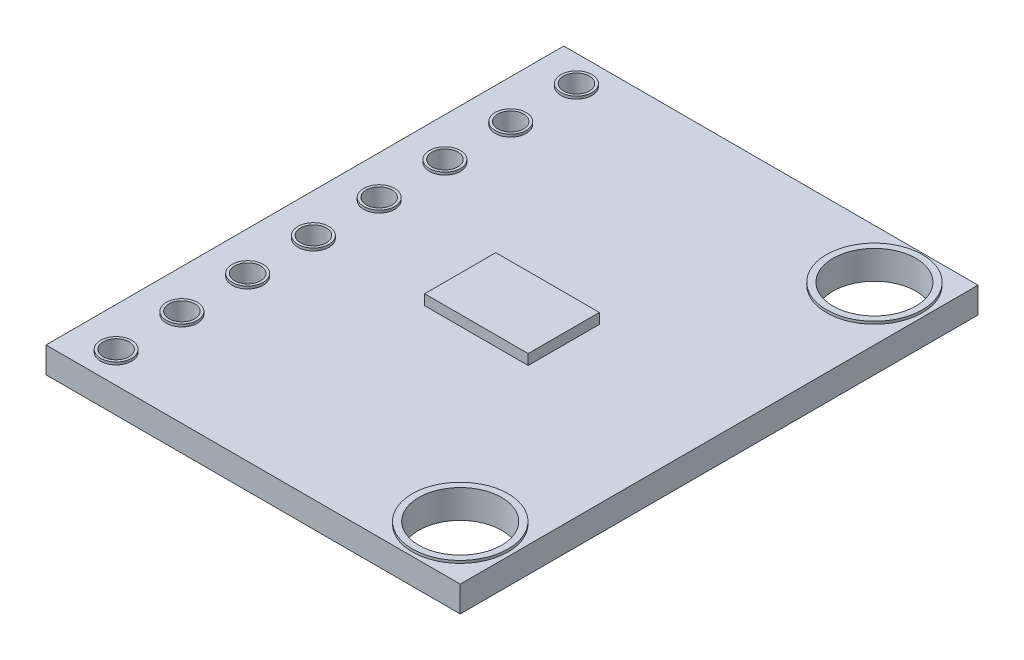
ISO-10303-21;
HEADER;
FILE_DESCRIPTION(('STEP AP214'),'2;1');
FILE_NAME('part.step','',(''),(''),'','','');
FILE_SCHEMA(('AUTOMOTIVE_DESIGN { 1 0 10303 214 1 1 1 1 }'));
ENDSEC;
DATA;
#1=APPLICATION_CONTEXT('core data for automotive mechanical design processes');
#2=APPLICATION_PROTOCOL_DEFINITION('international standard','automotive_design',2000,#1);
#3=PRODUCT_CONTEXT('',#1,'mechanical');
#4=PRODUCT('Part','Part','',(#3));
#5=PRODUCT_RELATED_PRODUCT_CATEGORY('part','',(#4));
#6=PRODUCT_DEFINITION_FORMATION('','',#4);
#7=PRODUCT_DEFINITION_CONTEXT('part definition',#1,'design');
#8=PRODUCT_DEFINITION('design','',#6,#7);
#9=PRODUCT_DEFINITION_SHAPE('','',#8);
#10=(LENGTH_UNIT() NAMED_UNIT(*) SI_UNIT(.MILLI.,.METRE.));
#11=(NAMED_UNIT(*) PLANE_ANGLE_UNIT() SI_UNIT($,.RADIAN.));
#12=(NAMED_UNIT(*) SI_UNIT($,.STERADIAN.) SOLID_ANGLE_UNIT());
#13=UNCERTAINTY_MEASURE_WITH_UNIT(LENGTH_MEASURE(1.E-05),#10,'distance_accuracy_value','');
#14=(GEOMETRIC_REPRESENTATION_CONTEXT(3) GLOBAL_UNCERTAINTY_ASSIGNED_CONTEXT((#13)) GLOBAL_UNIT_ASSIGNED_CONTEXT((#10,
#11,#12)) REPRESENTATION_CONTEXT('',''));
#15=CARTESIAN_POINT('',(0.,0.,0.));
#16=DIRECTION('',(0.,0.,1.));
#17=DIRECTION('',(1.,0.,0.));
#18=AXIS2_PLACEMENT_3D('',#15,#16,#17);
#19=CARTESIAN_POINT('',(2.,1.4,1.375));
#20=DIRECTION('',(-1.,0.,0.));
#21=DIRECTION('',(0.,0.,1.));
#22=AXIS2_PLACEMENT_3D('',#19,#20,#21);
#23=PLANE('',#22);
#24=DIRECTION('',(0.,0.,-1.));
#25=VECTOR('',#24,1.);
#26=CARTESIAN_POINT('',(2.,1.,1.375));
#27=LINE('',#26,#25);
#28=CARTESIAN_POINT('',(2.,1.,1.375));
#29=VERTEX_POINT('',#28);
#30=CARTESIAN_POINT('',(2.,1.,-1.375));
#31=VERTEX_POINT('',#30);
#32=EDGE_CURVE('E115',#29,#31,#27,.T.);
#33=ORIENTED_EDGE('',*,*,#32,.T.);
#34=DIRECTION('',(0.,-1.,0.));
#35=VECTOR('',#34,1.);
#36=CARTESIAN_POINT('',(2.,1.4,-1.375));
#37=LINE('',#36,#35);
#38=CARTESIAN_POINT('',(2.,1.4,-1.375));
#39=VERTEX_POINT('',#38);
#40=EDGE_CURVE('E12',#39,#31,#37,.T.);
#41=ORIENTED_EDGE('',*,*,#40,.F.);
#42=DIRECTION('',(0.,0.,-1.));
#43=VECTOR('',#42,1.);
#44=CARTESIAN_POINT('',(2.,1.4,1.375));
#45=LINE('',#44,#43);
#46=CARTESIAN_POINT('',(2.,1.4,1.375));
#47=VERTEX_POINT('',#46);
#48=EDGE_CURVE('E103',#47,#39,#45,.T.);
#49=ORIENTED_EDGE('',*,*,#48,.F.);
#50=DIRECTION('',(0.,-1.,0.));
#51=VECTOR('',#50,1.);
#52=CARTESIAN_POINT('',(2.,1.4,1.375));
#53=LINE('',#52,#51);
#54=EDGE_CURVE('E111',#47,#29,#53,.T.);
#55=ORIENTED_EDGE('',*,*,#54,.T.);
#56=EDGE_LOOP('',(#33,#41,#49,#55));
#57=FACE_BOUND('',#56,.T.);
#58=ADVANCED_FACE('F52',(#57),#23,.F.);
#59=CARTESIAN_POINT('',(-2.,1.4,-1.375));
#60=DIRECTION('',(0.,0.,1.));
#61=DIRECTION('',(1.,0.,0.));
#62=AXIS2_PLACEMENT_3D('',#59,#60,#61);
#63=PLANE('',#62);
#64=DIRECTION('',(-1.,0.,0.));
#65=VECTOR('',#64,1.);
#66=CARTESIAN_POINT('',(-2.,1.,-1.375));
#67=LINE('',#66,#65);
#68=CARTESIAN_POINT('',(-2.,1.,-1.375));
#69=VERTEX_POINT('',#68);
#70=EDGE_CURVE('E107',#31,#69,#67,.T.);
#71=ORIENTED_EDGE('',*,*,#70,.T.);
#72=DIRECTION('',(0.,-1.,0.));
#73=VECTOR('',#72,1.);
#74=CARTESIAN_POINT('',(-2.,1.4,-1.375));
#75=LINE('',#74,#73);
#76=CARTESIAN_POINT('',(-2.,1.4,-1.375));
#77=VERTEX_POINT('',#76);
#78=EDGE_CURVE('E60',#77,#69,#75,.T.);
#79=ORIENTED_EDGE('',*,*,#78,.F.);
#80=DIRECTION('',(-1.,0.,0.));
#81=VECTOR('',#80,1.);
#82=CARTESIAN_POINT('',(-2.,1.4,-1.375));
#83=LINE('',#82,#81);
#84=EDGE_CURVE('E98',#39,#77,#83,.T.);
#85=ORIENTED_EDGE('',*,*,#84,.F.);
#86=ORIENTED_EDGE('',*,*,#40,.T.);
#87=EDGE_LOOP('',(#71,#79,#85,#86));
#88=FACE_BOUND('',#87,.T.);
#89=ADVANCED_FACE('F106',(#88),#63,.F.);
#90=CARTESIAN_POINT('',(-2.,1.4,1.375));
#91=DIRECTION('',(1.,0.,0.));
#92=DIRECTION('',(0.,0.,-1.));
#93=AXIS2_PLACEMENT_3D('',#90,#91,#92);
#94=PLANE('',#93);
#95=DIRECTION('',(0.,0.,1.));
#96=VECTOR('',#95,1.);
#97=CARTESIAN_POINT('',(-2.,1.,1.375));
#98=LINE('',#97,#96);
#99=CARTESIAN_POINT('',(-2.,1.,1.375));
#100=VERTEX_POINT('',#99);
#101=EDGE_CURVE('E85',#69,#100,#98,.T.);
#102=ORIENTED_EDGE('',*,*,#101,.T.);
#103=DIRECTION('',(0.,-1.,0.));
#104=VECTOR('',#103,1.);
#105=CARTESIAN_POINT('',(-2.,1.4,1.375));
#106=LINE('',#105,#104);
#107=CARTESIAN_POINT('',(-2.,1.4,1.375));
#108=VERTEX_POINT('',#107);
#109=EDGE_CURVE('E108',#108,#100,#106,.T.);
#110=ORIENTED_EDGE('',*,*,#109,.F.);
#111=DIRECTION('',(0.,0.,1.));
#112=VECTOR('',#111,1.);
#113=CARTESIAN_POINT('',(-2.,1.4,1.375));
#114=LINE('',#113,#112);
#115=EDGE_CURVE('E101',#77,#108,#114,.T.);
#116=ORIENTED_EDGE('',*,*,#115,.F.);
#117=ORIENTED_EDGE('',*,*,#78,.T.);
#118=EDGE_LOOP('',(#102,#110,#116,#117));
#119=FACE_BOUND('',#118,.T.);
#120=ADVANCED_FACE('F109',(#119),#94,.F.);
#121=CARTESIAN_POINT('',(-2.,1.4,1.375));
#122=DIRECTION('',(0.,0.,-1.));
#123=DIRECTION('',(-1.,0.,0.));
#124=AXIS2_PLACEMENT_3D('',#121,#122,#123);
#125=PLANE('',#124);
#126=DIRECTION('',(1.,0.,0.));
#127=VECTOR('',#126,1.);
#128=CARTESIAN_POINT('',(-2.,1.,1.375));
#129=LINE('',#128,#127);
#130=EDGE_CURVE('E91',#100,#29,#129,.T.);
#131=ORIENTED_EDGE('',*,*,#130,.T.);
#132=ORIENTED_EDGE('',*,*,#54,.F.);
#133=DIRECTION('',(1.,0.,0.));
#134=VECTOR('',#133,1.);
#135=CARTESIAN_POINT('',(-2.,1.4,1.375));
#136=LINE('',#135,#134);
#137=EDGE_CURVE('E68',#108,#47,#136,.T.);
#138=ORIENTED_EDGE('',*,*,#137,.F.);
#139=ORIENTED_EDGE('',*,*,#109,.T.);
#140=EDGE_LOOP('',(#131,#132,#138,#139));
#141=FACE_BOUND('',#140,.T.);
#142=ADVANCED_FACE('F122',(#141),#125,.F.);
#143=CARTESIAN_POINT('',(0.,1.4,0.));
#144=DIRECTION('',(0.,-1.,0.));
#145=DIRECTION('',(0.,0.,-1.));
#146=AXIS2_PLACEMENT_3D('',#143,#144,#145);
#147=PLANE('',#146);
#148=ORIENTED_EDGE('',*,*,#48,.T.);
#149=ORIENTED_EDGE('',*,*,#84,.T.);
#150=ORIENTED_EDGE('',*,*,#115,.T.);
#151=ORIENTED_EDGE('',*,*,#137,.T.);
#152=EDGE_LOOP('',(#148,#149,#150,#151));
#153=FACE_BOUND('',#152,.T.);
#154=ADVANCED_FACE('F99',(#153),#147,.F.);
#155=CARTESIAN_POINT('',(0.,1.,0.));
#156=DIRECTION('',(0.,-1.,0.));
#157=DIRECTION('',(0.,0.,-1.));
#158=AXIS2_PLACEMENT_3D('',#155,#156,#157);
#159=PLANE('',#158);
#160=ORIENTED_EDGE('',*,*,#32,.F.);
#161=ORIENTED_EDGE('',*,*,#130,.F.);
#162=ORIENTED_EDGE('',*,*,#101,.F.);
#163=ORIENTED_EDGE('',*,*,#70,.F.);
#164=EDGE_LOOP('',(#160,#161,#162,#163));
#165=FACE_BOUND('',#164,.T.);
#166=ADVANCED_FACE('F125',(#165),#159,.T.);
#167=CLOSED_SHELL('',(#58,#89,#120,#142,#154,#166));
#168=MANIFOLD_SOLID_BREP('B2',#167);
#169=CARTESIAN_POINT('',(8.,1.,10.));
#170=DIRECTION('',(-1.,0.,0.));
#171=DIRECTION('',(0.,0.,1.));
#172=AXIS2_PLACEMENT_3D('',#169,#170,#171);
#173=PLANE('',#172);
#174=DIRECTION('',(0.,0.,-1.));
#175=VECTOR('',#174,1.);
#176=CARTESIAN_POINT('',(8.,0.,10.));
#177=LINE('',#176,#175);
#178=CARTESIAN_POINT('',(8.,0.,10.));
#179=VERTEX_POINT('',#178);
#180=CARTESIAN_POINT('',(8.,0.,-10.));
#181=VERTEX_POINT('',#180);
#182=EDGE_CURVE('E250',#179,#181,#177,.T.);
#183=ORIENTED_EDGE('',*,*,#182,.T.);
#184=DIRECTION('',(0.,-1.,0.));
#185=VECTOR('',#184,1.);
#186=CARTESIAN_POINT('',(8.,1.,-10.));
#187=LINE('',#186,#185);
#188=CARTESIAN_POINT('',(8.,1.,-10.));
#189=VERTEX_POINT('',#188);
#190=EDGE_CURVE('E239',#189,#181,#187,.T.);
#191=ORIENTED_EDGE('',*,*,#190,.F.);
#192=DIRECTION('',(0.,0.,-1.));
#193=VECTOR('',#192,1.);
#194=CARTESIAN_POINT('',(8.,1.,10.));
#195=LINE('',#194,#193);
#196=CARTESIAN_POINT('',(8.,1.,10.));
#197=VERTEX_POINT('',#196);
#198=EDGE_CURVE('E231',#197,#189,#195,.T.);
#199=ORIENTED_EDGE('',*,*,#198,.F.);
#200=DIRECTION('',(0.,-1.,0.));
#201=VECTOR('',#200,1.);
#202=CARTESIAN_POINT('',(8.,1.,10.));
#203=LINE('',#202,#201);
#204=EDGE_CURVE('E246',#197,#179,#203,.T.);
#205=ORIENTED_EDGE('',*,*,#204,.T.);
#206=EDGE_LOOP('',(#183,#191,#199,#205));
#207=FACE_BOUND('',#206,.T.);
#208=ADVANCED_FACE('F176',(#207),#173,.F.);
#209=CARTESIAN_POINT('',(-8.,1.,-10.));
#210=DIRECTION('',(0.,0.,1.));
#211=DIRECTION('',(1.,0.,0.));
#212=AXIS2_PLACEMENT_3D('',#209,#210,#211);
#213=PLANE('',#212);
#214=DIRECTION('',(-1.,0.,0.));
#215=VECTOR('',#214,1.);
#216=CARTESIAN_POINT('',(-8.,0.,-10.));
#217=LINE('',#216,#215);
#218=CARTESIAN_POINT('',(-8.,0.,-10.));
#219=VERTEX_POINT('',#218);
#220=EDGE_CURVE('E237',#181,#219,#217,.T.);
#221=ORIENTED_EDGE('',*,*,#220,.T.);
#222=DIRECTION('',(0.,-1.,0.));
#223=VECTOR('',#222,1.);
#224=CARTESIAN_POINT('',(-8.,1.,-10.));
#225=LINE('',#224,#223);
#226=CARTESIAN_POINT('',(-8.,1.,-10.));
#227=VERTEX_POINT('',#226);
#228=EDGE_CURVE('E235',#227,#219,#225,.T.);
#229=ORIENTED_EDGE('',*,*,#228,.F.);
#230=DIRECTION('',(-1.,0.,0.));
#231=VECTOR('',#230,1.);
#232=CARTESIAN_POINT('',(-8.,1.,-10.));
#233=LINE('',#232,#231);
#234=EDGE_CURVE('E226',#189,#227,#233,.T.);
#235=ORIENTED_EDGE('',*,*,#234,.F.);
#236=ORIENTED_EDGE('',*,*,#190,.T.);
#237=EDGE_LOOP('',(#221,#229,#235,#236));
#238=FACE_BOUND('',#237,.T.);
#239=ADVANCED_FACE('F236',(#238),#213,.F.);
#240=CARTESIAN_POINT('',(-8.,1.,10.));
#241=DIRECTION('',(1.,0.,0.));
#242=DIRECTION('',(0.,0.,-1.));
#243=AXIS2_PLACEMENT_3D('',#240,#241,#242);
#244=PLANE('',#243);
#245=DIRECTION('',(0.,0.,1.));
#246=VECTOR('',#245,1.);
#247=CARTESIAN_POINT('',(-8.,0.,10.));
#248=LINE('',#247,#246);
#249=CARTESIAN_POINT('',(-8.,0.,10.));
#250=VERTEX_POINT('',#249);
#251=EDGE_CURVE('E212',#219,#250,#248,.T.);
#252=ORIENTED_EDGE('',*,*,#251,.T.);
#253=DIRECTION('',(0.,-1.,0.));
#254=VECTOR('',#253,1.);
#255=CARTESIAN_POINT('',(-8.,1.,10.));
#256=LINE('',#255,#254);
#257=CARTESIAN_POINT('',(-8.,1.,10.));
#258=VERTEX_POINT('',#257);
#259=EDGE_CURVE('E240',#258,#250,#256,.T.);
#260=ORIENTED_EDGE('',*,*,#259,.F.);
#261=DIRECTION('',(0.,0.,1.));
#262=VECTOR('',#261,1.);
#263=CARTESIAN_POINT('',(-8.,1.,10.));
#264=LINE('',#263,#262);
#265=EDGE_CURVE('E229',#227,#258,#264,.T.);
#266=ORIENTED_EDGE('',*,*,#265,.F.);
#267=ORIENTED_EDGE('',*,*,#228,.T.);
#268=EDGE_LOOP('',(#252,#260,#266,#267));
#269=FACE_BOUND('',#268,.T.);
#270=ADVANCED_FACE('F242',(#269),#244,.F.);
#271=CARTESIAN_POINT('',(-8.,1.,10.));
#272=DIRECTION('',(0.,0.,-1.));
#273=DIRECTION('',(-1.,0.,0.));
#274=AXIS2_PLACEMENT_3D('',#271,#272,#273);
#275=PLANE('',#274);
#276=DIRECTION('',(1.,0.,0.));
#277=VECTOR('',#276,1.);
#278=CARTESIAN_POINT('',(-8.,0.,10.));
#279=LINE('',#278,#277);
#280=EDGE_CURVE('E218',#250,#179,#279,.T.);
#281=ORIENTED_EDGE('',*,*,#280,.T.);
#282=ORIENTED_EDGE('',*,*,#204,.F.);
#283=DIRECTION('',(1.,0.,0.));
#284=VECTOR('',#283,1.);
#285=CARTESIAN_POINT('',(-8.,1.,10.));
#286=LINE('',#285,#284);
#287=EDGE_CURVE('E195',#258,#197,#286,.T.);
#288=ORIENTED_EDGE('',*,*,#287,.F.);
#289=ORIENTED_EDGE('',*,*,#259,.T.);
#290=EDGE_LOOP('',(#281,#282,#288,#289));
#291=FACE_BOUND('',#290,.T.);
#292=ADVANCED_FACE('F438',(#291),#275,.F.);
#293=CARTESIAN_POINT('',(0.,1.,0.));
#294=DIRECTION('',(0.,-1.,0.));
#295=DIRECTION('',(0.,0.,-1.));
#296=AXIS2_PLACEMENT_3D('',#293,#294,#295);
#297=PLANE('',#296);
#298=CARTESIAN_POINT('',(6.,1.,-8.));
#299=DIRECTION('',(0.,-1.,0.));
#300=DIRECTION('',(0.,0.,-1.));
#301=AXIS2_PLACEMENT_3D('',#298,#299,#300);
#302=CIRCLE('',#301,1.85);
#303=CARTESIAN_POINT('',(6.,1.,-9.85));
#304=VERTEX_POINT('',#303);
#305=EDGE_CURVE('E50',#304,#304,#302,.F.);
#306=ORIENTED_EDGE('',*,*,#305,.F.);
#307=EDGE_LOOP('',(#306));
#308=FACE_BOUND('',#307,.T.);
#309=CARTESIAN_POINT('',(6.,1.,8.));
#310=DIRECTION('',(0.,-1.,0.));
#311=DIRECTION('',(0.,0.,-1.));
#312=AXIS2_PLACEMENT_3D('',#309,#310,#311);
#313=CIRCLE('',#312,1.85);
#314=CARTESIAN_POINT('',(6.,1.,6.15));
#315=VERTEX_POINT('',#314);
#316=EDGE_CURVE('E186',#315,#315,#313,.F.);
#317=ORIENTED_EDGE('',*,*,#316,.F.);
#318=EDGE_LOOP('',(#317));
#319=FACE_BOUND('',#318,.T.);
#320=CARTESIAN_POINT('',(-6.40078584342518,1.,-8.89000000000001));
#321=DIRECTION('',(0.,-1.,0.));
#322=DIRECTION('',(0.,0.,-1.));
#323=AXIS2_PLACEMENT_3D('',#320,#321,#322);
#324=CIRCLE('',#323,0.6);
#325=CARTESIAN_POINT('',(-6.40078584342518,1.,-9.49000000000001));
#326=VERTEX_POINT('',#325);
#327=EDGE_CURVE('E295',#326,#326,#324,.F.);
#328=ORIENTED_EDGE('',*,*,#327,.F.);
#329=EDGE_LOOP('',(#328));
#330=FACE_BOUND('',#329,.T.);
#331=CARTESIAN_POINT('',(-6.40078584342518,1.,-6.35));
#332=DIRECTION('',(0.,-1.,0.));
#333=DIRECTION('',(0.,0.,-1.));
#334=AXIS2_PLACEMENT_3D('',#331,#332,#333);
#335=CIRCLE('',#334,0.6);
#336=CARTESIAN_POINT('',(-6.40078584342518,1.,-6.95));
#337=VERTEX_POINT('',#336);
#338=EDGE_CURVE('E291',#337,#337,#335,.F.);
#339=ORIENTED_EDGE('',*,*,#338,.F.);
#340=EDGE_LOOP('',(#339));
#341=FACE_BOUND('',#340,.T.);
#342=CARTESIAN_POINT('',(-6.40078584342518,1.,-3.81));
#343=DIRECTION('',(0.,-1.,0.));
#344=DIRECTION('',(0.,0.,-1.));
#345=AXIS2_PLACEMENT_3D('',#342,#343,#344);
#346=CIRCLE('',#345,0.6);
#347=CARTESIAN_POINT('',(-6.40078584342518,1.,-4.41));
#348=VERTEX_POINT('',#347);
#349=EDGE_CURVE('E287',#348,#348,#346,.F.);
#350=ORIENTED_EDGE('',*,*,#349,.F.);
#351=EDGE_LOOP('',(#350));
#352=FACE_BOUND('',#351,.T.);
#353=CARTESIAN_POINT('',(-6.40078584342518,1.,-1.27));
#354=DIRECTION('',(0.,-1.,0.));
#355=DIRECTION('',(0.,0.,-1.));
#356=AXIS2_PLACEMENT_3D('',#353,#354,#355);
#357=CIRCLE('',#356,0.6);
#358=CARTESIAN_POINT('',(-6.40078584342518,1.,-1.87));
#359=VERTEX_POINT('',#358);
#360=EDGE_CURVE('E283',#359,#359,#357,.F.);
#361=ORIENTED_EDGE('',*,*,#360,.F.);
#362=EDGE_LOOP('',(#361));
#363=FACE_BOUND('',#362,.T.);
#364=CARTESIAN_POINT('',(-6.40078584342518,1.,8.89));
#365=DIRECTION('',(0.,-1.,0.));
#366=DIRECTION('',(0.,0.,-1.));
#367=AXIS2_PLACEMENT_3D('',#364,#365,#366);
#368=CIRCLE('',#367,0.6);
#369=CARTESIAN_POINT('',(-6.40078584342518,1.,8.29));
#370=VERTEX_POINT('',#369);
#371=EDGE_CURVE('E279',#370,#370,#368,.F.);
#372=ORIENTED_EDGE('',*,*,#371,.F.);
#373=EDGE_LOOP('',(#372));
#374=FACE_BOUND('',#373,.T.);
#375=CARTESIAN_POINT('',(-6.40078584342518,1.,1.27));
#376=DIRECTION('',(0.,-1.,0.));
#377=DIRECTION('',(0.,0.,-1.));
#378=AXIS2_PLACEMENT_3D('',#375,#376,#377);
#379=CIRCLE('',#378,0.6);
#380=CARTESIAN_POINT('',(-6.40078584342518,1.,0.669999999999995));
#381=VERTEX_POINT('',#380);
#382=EDGE_CURVE('E275',#381,#381,#379,.F.);
#383=ORIENTED_EDGE('',*,*,#382,.F.);
#384=EDGE_LOOP('',(#383));
#385=FACE_BOUND('',#384,.T.);
#386=CARTESIAN_POINT('',(-6.40078584342518,1.,3.81));
#387=DIRECTION('',(0.,-1.,0.));
#388=DIRECTION('',(0.,0.,-1.));
#389=AXIS2_PLACEMENT_3D('',#386,#387,#388);
#390=CIRCLE('',#389,0.6);
#391=CARTESIAN_POINT('',(-6.40078584342518,1.,3.21));
#392=VERTEX_POINT('',#391);
#393=EDGE_CURVE('E271',#392,#392,#390,.F.);
#394=ORIENTED_EDGE('',*,*,#393,.F.);
#395=EDGE_LOOP('',(#394));
#396=FACE_BOUND('',#395,.T.);
#397=CARTESIAN_POINT('',(-6.40078584342518,1.,6.35));
#398=DIRECTION('',(0.,-1.,0.));
#399=DIRECTION('',(0.,0.,-1.));
#400=AXIS2_PLACEMENT_3D('',#397,#398,#399);
#401=CIRCLE('',#400,0.6);
#402=CARTESIAN_POINT('',(-6.40078584342518,1.,5.75));
#403=VERTEX_POINT('',#402);
#404=EDGE_CURVE('E267',#403,#403,#401,.F.);
#405=ORIENTED_EDGE('',*,*,#404,.F.);
#406=EDGE_LOOP('',(#405));
#407=FACE_BOUND('',#406,.T.);
#408=ORIENTED_EDGE('',*,*,#198,.T.);
#409=ORIENTED_EDGE('',*,*,#234,.T.);
#410=ORIENTED_EDGE('',*,*,#265,.T.);
#411=ORIENTED_EDGE('',*,*,#287,.T.);
#412=EDGE_LOOP('',(#408,#409,#410,#411));
#413=FACE_BOUND('',#412,.T.);
#414=ADVANCED_FACE('F227',(#308,#319,#330,#341,#352,#363,#374,#385,#396,#407,#413),#297,.F.);
#415=CARTESIAN_POINT('',(0.,0.,0.));
#416=DIRECTION('',(0.,-1.,0.));
#417=DIRECTION('',(0.,0.,-1.));
#418=AXIS2_PLACEMENT_3D('',#415,#416,#417);
#419=PLANE('',#418);
#420=CARTESIAN_POINT('',(6.,0.,-8.));
#421=DIRECTION('',(0.,-1.,0.));
#422=DIRECTION('',(0.,0.,-1.));
#423=AXIS2_PLACEMENT_3D('',#420,#421,#422);
#424=CIRCLE('',#423,1.6);
#425=CARTESIAN_POINT('',(6.,0.,-9.6));
#426=VERTEX_POINT('',#425);
#427=EDGE_CURVE('E179',#426,#426,#424,.T.);
#428=ORIENTED_EDGE('',*,*,#427,.F.);
#429=EDGE_LOOP('',(#428));
#430=FACE_BOUND('',#429,.T.);
#431=CARTESIAN_POINT('',(6.,0.,8.));
#432=DIRECTION('',(0.,-1.,0.));
#433=DIRECTION('',(0.,0.,-1.));
#434=AXIS2_PLACEMENT_3D('',#431,#432,#433);
#435=CIRCLE('',#434,1.6);
#436=CARTESIAN_POINT('',(6.,0.,6.4));
#437=VERTEX_POINT('',#436);
#438=EDGE_CURVE('E335',#437,#437,#435,.T.);
#439=ORIENTED_EDGE('',*,*,#438,.F.);
#440=EDGE_LOOP('',(#439));
#441=FACE_BOUND('',#440,.T.);
#442=CARTESIAN_POINT('',(-6.40078584342518,0.,8.89));
#443=DIRECTION('',(0.,-1.,0.));
#444=DIRECTION('',(0.,0.,-1.));
#445=AXIS2_PLACEMENT_3D('',#442,#443,#444);
#446=CIRCLE('',#445,0.500000000000001);
#447=CARTESIAN_POINT('',(-6.40078584342518,0.,8.39));
#448=VERTEX_POINT('',#447);
#449=EDGE_CURVE('E328',#448,#448,#446,.T.);
#450=ORIENTED_EDGE('',*,*,#449,.F.);
#451=EDGE_LOOP('',(#450));
#452=FACE_BOUND('',#451,.T.);
#453=CARTESIAN_POINT('',(-6.40078584342518,0.,6.35));
#454=DIRECTION('',(0.,-1.,0.));
#455=DIRECTION('',(0.,0.,-1.));
#456=AXIS2_PLACEMENT_3D('',#453,#454,#455);
#457=CIRCLE('',#456,0.5);
#458=CARTESIAN_POINT('',(-6.40078584342518,0.,5.85));
#459=VERTEX_POINT('',#458);
#460=EDGE_CURVE('E324',#459,#459,#457,.T.);
#461=ORIENTED_EDGE('',*,*,#460,.F.);
#462=EDGE_LOOP('',(#461));
#463=FACE_BOUND('',#462,.T.);
#464=CARTESIAN_POINT('',(-6.40078584342518,0.,3.81));
#465=DIRECTION('',(0.,-1.,0.));
#466=DIRECTION('',(0.,0.,-1.));
#467=AXIS2_PLACEMENT_3D('',#464,#465,#466);
#468=CIRCLE('',#467,0.500000000000002);
#469=CARTESIAN_POINT('',(-6.40078584342518,0.,3.30999999999999));
#470=VERTEX_POINT('',#469);
#471=EDGE_CURVE('E320',#470,#470,#468,.T.);
#472=ORIENTED_EDGE('',*,*,#471,.F.);
#473=EDGE_LOOP('',(#472));
#474=FACE_BOUND('',#473,.T.);
#475=CARTESIAN_POINT('',(-6.40078584342518,0.,1.27));
#476=DIRECTION('',(0.,-1.,0.));
#477=DIRECTION('',(0.,0.,-1.));
#478=AXIS2_PLACEMENT_3D('',#475,#476,#477);
#479=CIRCLE('',#478,0.500000000000002);
#480=CARTESIAN_POINT('',(-6.40078584342518,0.,0.769999999999994));
#481=VERTEX_POINT('',#480);
#482=EDGE_CURVE('E316',#481,#481,#479,.T.);
#483=ORIENTED_EDGE('',*,*,#482,.F.);
#484=EDGE_LOOP('',(#483));
#485=FACE_BOUND('',#484,.T.);
#486=CARTESIAN_POINT('',(-6.40078584342518,0.,-1.27));
#487=DIRECTION('',(0.,-1.,0.));
#488=DIRECTION('',(0.,0.,-1.));
#489=AXIS2_PLACEMENT_3D('',#486,#487,#488);
#490=CIRCLE('',#489,0.500000000000002);
#491=CARTESIAN_POINT('',(-6.40078584342518,0.,-1.77000000000001));
#492=VERTEX_POINT('',#491);
#493=EDGE_CURVE('E312',#492,#492,#490,.T.);
#494=ORIENTED_EDGE('',*,*,#493,.F.);
#495=EDGE_LOOP('',(#494));
#496=FACE_BOUND('',#495,.T.);
#497=CARTESIAN_POINT('',(-6.40078584342518,0.,-3.81));
#498=DIRECTION('',(0.,-1.,0.));
#499=DIRECTION('',(0.,0.,-1.));
#500=AXIS2_PLACEMENT_3D('',#497,#498,#499);
#501=CIRCLE('',#500,0.500000000000002);
#502=CARTESIAN_POINT('',(-6.40078584342518,0.,-4.31));
#503=VERTEX_POINT('',#502);
#504=EDGE_CURVE('E308',#503,#503,#501,.T.);
#505=ORIENTED_EDGE('',*,*,#504,.F.);
#506=EDGE_LOOP('',(#505));
#507=FACE_BOUND('',#506,.T.);
#508=CARTESIAN_POINT('',(-6.40078584342518,0.,-6.35));
#509=DIRECTION('',(0.,-1.,0.));
#510=DIRECTION('',(0.,0.,-1.));
#511=AXIS2_PLACEMENT_3D('',#508,#509,#510);
#512=CIRCLE('',#511,0.500000000000002);
#513=CARTESIAN_POINT('',(-6.40078584342518,0.,-6.85000000000001));
#514=VERTEX_POINT('',#513);
#515=EDGE_CURVE('E303',#514,#514,#512,.T.);
#516=ORIENTED_EDGE('',*,*,#515,.F.);
#517=EDGE_LOOP('',(#516));
#518=FACE_BOUND('',#517,.T.);
#519=CARTESIAN_POINT('',(-6.40078584342518,0.,-8.89000000000001));
#520=DIRECTION('',(0.,-1.,0.));
#521=DIRECTION('',(0.,0.,-1.));
#522=AXIS2_PLACEMENT_3D('',#519,#520,#521);
#523=CIRCLE('',#522,0.500000000000003);
#524=CARTESIAN_POINT('',(-6.40078584342518,0.,-9.39000000000001));
#525=VERTEX_POINT('',#524);
#526=EDGE_CURVE('E299',#525,#525,#523,.T.);
#527=ORIENTED_EDGE('',*,*,#526,.F.);
#528=EDGE_LOOP('',(#527));
#529=FACE_BOUND('',#528,.T.);
#530=ORIENTED_EDGE('',*,*,#182,.F.);
#531=ORIENTED_EDGE('',*,*,#280,.F.);
#532=ORIENTED_EDGE('',*,*,#251,.F.);
#533=ORIENTED_EDGE('',*,*,#220,.F.);
#534=EDGE_LOOP('',(#530,#531,#532,#533));
#535=FACE_BOUND('',#534,.T.);
#536=ADVANCED_FACE('F437',(#430,#441,#452,#463,#474,#485,#496,#507,#518,#529,#535),#419,.T.);
#537=CARTESIAN_POINT('',(-6.40078584342518,1.1,6.35));
#538=DIRECTION('',(0.,1.,0.));
#539=DIRECTION('',(0.,0.,1.));
#540=AXIS2_PLACEMENT_3D('',#537,#538,#539);
#541=PLANE('',#540);
#542=CARTESIAN_POINT('',(-6.40078584342518,1.1,6.35));
#543=DIRECTION('',(0.,1.,0.));
#544=DIRECTION('',(0.,0.,1.));
#545=AXIS2_PLACEMENT_3D('',#542,#543,#544);
#546=CIRCLE('',#545,0.6);
#547=CARTESIAN_POINT('',(-6.40078584342518,1.1,6.95));
#548=VERTEX_POINT('',#547);
#549=EDGE_CURVE('E254',#548,#548,#546,.T.);
#550=ORIENTED_EDGE('',*,*,#549,.T.);
#551=EDGE_LOOP('',(#550));
#552=FACE_BOUND('',#551,.T.);
#553=CARTESIAN_POINT('',(-6.40078584342518,1.1,6.35));
#554=DIRECTION('',(0.,1.,0.));
#555=DIRECTION('',(0.,0.,1.));
#556=AXIS2_PLACEMENT_3D('',#553,#554,#555);
#557=CIRCLE('',#556,0.500000000000001);
#558=CARTESIAN_POINT('',(-6.40078584342518,1.1,6.85));
#559=VERTEX_POINT('',#558);
#560=EDGE_CURVE('E417',#559,#559,#557,.T.);
#561=ORIENTED_EDGE('',*,*,#560,.F.);
#562=EDGE_LOOP('',(#561));
#563=FACE_BOUND('',#562,.T.);
#564=ADVANCED_FACE('F426',(#552,#563),#541,.T.);
#565=CARTESIAN_POINT('',(-6.40078584342518,1.1,6.35));
#566=DIRECTION('',(0.,-1.,0.));
#567=DIRECTION('',(0.,0.,-1.));
#568=AXIS2_PLACEMENT_3D('',#565,#566,#567);
#569=CYLINDRICAL_SURFACE('',#568,0.6);
#570=ORIENTED_EDGE('',*,*,#549,.F.);
#571=EDGE_LOOP('',(#570));
#572=FACE_BOUND('',#571,.T.);
#573=ORIENTED_EDGE('',*,*,#404,.T.);
#574=EDGE_LOOP('',(#573));
#575=FACE_BOUND('',#574,.T.);
#576=ADVANCED_FACE('F429',(#572,#575),#569,.T.);
#577=CARTESIAN_POINT('',(-6.40078584342518,1.1,6.35));
#578=DIRECTION('',(0.,-1.,0.));
#579=DIRECTION('',(0.,0.,-1.));
#580=AXIS2_PLACEMENT_3D('',#577,#578,#579);
#581=CYLINDRICAL_SURFACE('',#580,0.500000000000001);
#582=ORIENTED_EDGE('',*,*,#560,.T.);
#583=EDGE_LOOP('',(#582));
#584=FACE_BOUND('',#583,.T.);
#585=ORIENTED_EDGE('',*,*,#460,.T.);
#586=EDGE_LOOP('',(#585));
#587=FACE_BOUND('',#586,.T.);
#588=ADVANCED_FACE('F432',(#584,#587),#581,.F.);
#589=CARTESIAN_POINT('',(-6.40078584342518,1.1,3.81));
#590=DIRECTION('',(0.,1.,0.));
#591=DIRECTION('',(0.,0.,1.));
#592=AXIS2_PLACEMENT_3D('',#589,#590,#591);
#593=PLANE('',#592);
#594=CARTESIAN_POINT('',(-6.40078584342518,1.1,3.81));
#595=DIRECTION('',(0.,1.,0.));
#596=DIRECTION('',(0.,0.,1.));
#597=AXIS2_PLACEMENT_3D('',#594,#595,#596);
#598=CIRCLE('',#597,0.6);
#599=CARTESIAN_POINT('',(-6.40078584342518,1.1,4.41));
#600=VERTEX_POINT('',#599);
#601=EDGE_CURVE('E413',#600,#600,#598,.T.);
#602=ORIENTED_EDGE('',*,*,#601,.T.);
#603=EDGE_LOOP('',(#602));
#604=FACE_BOUND('',#603,.T.);
#605=CARTESIAN_POINT('',(-6.40078584342518,1.1,3.81));
#606=DIRECTION('',(0.,1.,0.));
#607=DIRECTION('',(0.,0.,1.));
#608=AXIS2_PLACEMENT_3D('',#605,#606,#607);
#609=CIRCLE('',#608,0.500000000000002);
#610=CARTESIAN_POINT('',(-6.40078584342518,1.1,4.31));
#611=VERTEX_POINT('',#610);
#612=EDGE_CURVE('E409',#611,#611,#609,.T.);
#613=ORIENTED_EDGE('',*,*,#612,.F.);
#614=EDGE_LOOP('',(#613));
#615=FACE_BOUND('',#614,.T.);
#616=ADVANCED_FACE('F490',(#604,#615),#593,.T.);
#617=CARTESIAN_POINT('',(-6.40078584342518,1.1,3.81));
#618=DIRECTION('',(0.,-1.,0.));
#619=DIRECTION('',(0.,0.,-1.));
#620=AXIS2_PLACEMENT_3D('',#617,#618,#619);
#621=CYLINDRICAL_SURFACE('',#620,0.6);
#622=ORIENTED_EDGE('',*,*,#601,.F.);
#623=EDGE_LOOP('',(#622));
#624=FACE_BOUND('',#623,.T.);
#625=ORIENTED_EDGE('',*,*,#393,.T.);
#626=EDGE_LOOP('',(#625));
#627=FACE_BOUND('',#626,.T.);
#628=ADVANCED_FACE('F495',(#624,#627),#621,.T.);
#629=CARTESIAN_POINT('',(-6.40078584342518,1.1,3.81));
#630=DIRECTION('',(0.,-1.,0.));
#631=DIRECTION('',(0.,0.,-1.));
#632=AXIS2_PLACEMENT_3D('',#629,#630,#631);
#633=CYLINDRICAL_SURFACE('',#632,0.500000000000002);
#634=ORIENTED_EDGE('',*,*,#612,.T.);
#635=EDGE_LOOP('',(#634));
#636=FACE_BOUND('',#635,.T.);
#637=ORIENTED_EDGE('',*,*,#471,.T.);
#638=EDGE_LOOP('',(#637));
#639=FACE_BOUND('',#638,.T.);
#640=ADVANCED_FACE('F505',(#636,#639),#633,.F.);
#641=CARTESIAN_POINT('',(-6.40078584342518,1.1,1.27));
#642=DIRECTION('',(0.,1.,0.));
#643=DIRECTION('',(0.,0.,1.));
#644=AXIS2_PLACEMENT_3D('',#641,#642,#643);
#645=PLANE('',#644);
#646=CARTESIAN_POINT('',(-6.40078584342518,1.1,1.27));
#647=DIRECTION('',(0.,1.,0.));
#648=DIRECTION('',(0.,0.,1.));
#649=AXIS2_PLACEMENT_3D('',#646,#647,#648);
#650=CIRCLE('',#649,0.6);
#651=CARTESIAN_POINT('',(-6.40078584342518,1.1,1.87));
#652=VERTEX_POINT('',#651);
#653=EDGE_CURVE('E405',#652,#652,#650,.T.);
#654=ORIENTED_EDGE('',*,*,#653,.T.);
#655=EDGE_LOOP('',(#654));
#656=FACE_BOUND('',#655,.T.);
#657=CARTESIAN_POINT('',(-6.40078584342518,1.1,1.27));
#658=DIRECTION('',(0.,1.,0.));
#659=DIRECTION('',(0.,0.,1.));
#660=AXIS2_PLACEMENT_3D('',#657,#658,#659);
#661=CIRCLE('',#660,0.500000000000002);
#662=CARTESIAN_POINT('',(-6.40078584342518,1.1,1.77));
#663=VERTEX_POINT('',#662);
#664=EDGE_CURVE('E401',#663,#663,#661,.T.);
#665=ORIENTED_EDGE('',*,*,#664,.F.);
#666=EDGE_LOOP('',(#665));
#667=FACE_BOUND('',#666,.T.);
#668=ADVANCED_FACE('F513',(#656,#667),#645,.T.);
#669=CARTESIAN_POINT('',(-6.40078584342518,1.1,1.27));
#670=DIRECTION('',(0.,-1.,0.));
#671=DIRECTION('',(0.,0.,-1.));
#672=AXIS2_PLACEMENT_3D('',#669,#670,#671);
#673=CYLINDRICAL_SURFACE('',#672,0.6);
#674=ORIENTED_EDGE('',*,*,#653,.F.);
#675=EDGE_LOOP('',(#674));
#676=FACE_BOUND('',#675,.T.);
#677=ORIENTED_EDGE('',*,*,#382,.T.);
#678=EDGE_LOOP('',(#677));
#679=FACE_BOUND('',#678,.T.);
#680=ADVANCED_FACE('F518',(#676,#679),#673,.T.);
#681=CARTESIAN_POINT('',(-6.40078584342518,1.1,1.27));
#682=DIRECTION('',(0.,-1.,0.));
#683=DIRECTION('',(0.,0.,-1.));
#684=AXIS2_PLACEMENT_3D('',#681,#682,#683);
#685=CYLINDRICAL_SURFACE('',#684,0.500000000000002);
#686=ORIENTED_EDGE('',*,*,#664,.T.);
#687=EDGE_LOOP('',(#686));
#688=FACE_BOUND('',#687,.T.);
#689=ORIENTED_EDGE('',*,*,#482,.T.);
#690=EDGE_LOOP('',(#689));
#691=FACE_BOUND('',#690,.T.);
#692=ADVANCED_FACE('F528',(#688,#691),#685,.F.);
#693=CARTESIAN_POINT('',(-6.40078584342518,1.1,8.89));
#694=DIRECTION('',(0.,1.,0.));
#695=DIRECTION('',(0.,0.,1.));
#696=AXIS2_PLACEMENT_3D('',#693,#694,#695);
#697=PLANE('',#696);
#698=CARTESIAN_POINT('',(-6.40078584342518,1.1,8.89));
#699=DIRECTION('',(0.,1.,0.));
#700=DIRECTION('',(0.,0.,1.));
#701=AXIS2_PLACEMENT_3D('',#698,#699,#700);
#702=CIRCLE('',#701,0.6);
#703=CARTESIAN_POINT('',(-6.40078584342518,1.1,9.49));
#704=VERTEX_POINT('',#703);
#705=EDGE_CURVE('E397',#704,#704,#702,.T.);
#706=ORIENTED_EDGE('',*,*,#705,.T.);
#707=EDGE_LOOP('',(#706));
#708=FACE_BOUND('',#707,.T.);
#709=CARTESIAN_POINT('',(-6.40078584342518,1.1,8.89));
#710=DIRECTION('',(0.,1.,0.));
#711=DIRECTION('',(0.,0.,1.));
#712=AXIS2_PLACEMENT_3D('',#709,#710,#711);
#713=CIRCLE('',#712,0.500000000000001);
#714=CARTESIAN_POINT('',(-6.40078584342518,1.1,9.39));
#715=VERTEX_POINT('',#714);
#716=EDGE_CURVE('E393',#715,#715,#713,.T.);
#717=ORIENTED_EDGE('',*,*,#716,.F.);
#718=EDGE_LOOP('',(#717));
#719=FACE_BOUND('',#718,.T.);
#720=ADVANCED_FACE('F536',(#708,#719),#697,.T.);
#721=CARTESIAN_POINT('',(-6.40078584342518,1.1,8.89));
#722=DIRECTION('',(0.,-1.,0.));
#723=DIRECTION('',(0.,0.,-1.));
#724=AXIS2_PLACEMENT_3D('',#721,#722,#723);
#725=CYLINDRICAL_SURFACE('',#724,0.6);
#726=ORIENTED_EDGE('',*,*,#705,.F.);
#727=EDGE_LOOP('',(#726));
#728=FACE_BOUND('',#727,.T.);
#729=ORIENTED_EDGE('',*,*,#371,.T.);
#730=EDGE_LOOP('',(#729));
#731=FACE_BOUND('',#730,.T.);
#732=ADVANCED_FACE('F541',(#728,#731),#725,.T.);
#733=CARTESIAN_POINT('',(-6.40078584342518,1.1,8.89));
#734=DIRECTION('',(0.,-1.,0.));
#735=DIRECTION('',(0.,0.,-1.));
#736=AXIS2_PLACEMENT_3D('',#733,#734,#735);
#737=CYLINDRICAL_SURFACE('',#736,0.500000000000001);
#738=ORIENTED_EDGE('',*,*,#716,.T.);
#739=EDGE_LOOP('',(#738));
#740=FACE_BOUND('',#739,.T.);
#741=ORIENTED_EDGE('',*,*,#449,.T.);
#742=EDGE_LOOP('',(#741));
#743=FACE_BOUND('',#742,.T.);
#744=ADVANCED_FACE('F551',(#740,#743),#737,.F.);
#745=CARTESIAN_POINT('',(-6.40078584342518,1.1,-1.27));
#746=DIRECTION('',(0.,1.,0.));
#747=DIRECTION('',(0.,0.,1.));
#748=AXIS2_PLACEMENT_3D('',#745,#746,#747);
#749=PLANE('',#748);
#750=CARTESIAN_POINT('',(-6.40078584342518,1.1,-1.27));
#751=DIRECTION('',(0.,1.,0.));
#752=DIRECTION('',(0.,0.,1.));
#753=AXIS2_PLACEMENT_3D('',#750,#751,#752);
#754=CIRCLE('',#753,0.6);
#755=CARTESIAN_POINT('',(-6.40078584342518,1.1,-0.670000000000004));
#756=VERTEX_POINT('',#755);
#757=EDGE_CURVE('E389',#756,#756,#754,.T.);
#758=ORIENTED_EDGE('',*,*,#757,.T.);
#759=EDGE_LOOP('',(#758));
#760=FACE_BOUND('',#759,.T.);
#761=CARTESIAN_POINT('',(-6.40078584342518,1.1,-1.27));
#762=DIRECTION('',(0.,1.,0.));
#763=DIRECTION('',(0.,0.,1.));
#764=AXIS2_PLACEMENT_3D('',#761,#762,#763);
#765=CIRCLE('',#764,0.500000000000002);
#766=CARTESIAN_POINT('',(-6.40078584342518,1.1,-0.770000000000003));
#767=VERTEX_POINT('',#766);
#768=EDGE_CURVE('E385',#767,#767,#765,.T.);
#769=ORIENTED_EDGE('',*,*,#768,.F.);
#770=EDGE_LOOP('',(#769));
#771=FACE_BOUND('',#770,.T.);
#772=ADVANCED_FACE('F559',(#760,#771),#749,.T.);
#773=CARTESIAN_POINT('',(-6.40078584342518,1.1,-1.27));
#774=DIRECTION('',(0.,-1.,0.));
#775=DIRECTION('',(0.,0.,-1.));
#776=AXIS2_PLACEMENT_3D('',#773,#774,#775);
#777=CYLINDRICAL_SURFACE('',#776,0.6);
#778=ORIENTED_EDGE('',*,*,#757,.F.);
#779=EDGE_LOOP('',(#778));
#780=FACE_BOUND('',#779,.T.);
#781=ORIENTED_EDGE('',*,*,#360,.T.);
#782=EDGE_LOOP('',(#781));
#783=FACE_BOUND('',#782,.T.);
#784=ADVANCED_FACE('F564',(#780,#783),#777,.T.);
#785=CARTESIAN_POINT('',(-6.40078584342518,1.1,-1.27));
#786=DIRECTION('',(0.,-1.,0.));
#787=DIRECTION('',(0.,0.,-1.));
#788=AXIS2_PLACEMENT_3D('',#785,#786,#787);
#789=CYLINDRICAL_SURFACE('',#788,0.500000000000002);
#790=ORIENTED_EDGE('',*,*,#768,.T.);
#791=EDGE_LOOP('',(#790));
#792=FACE_BOUND('',#791,.T.);
#793=ORIENTED_EDGE('',*,*,#493,.T.);
#794=EDGE_LOOP('',(#793));
#795=FACE_BOUND('',#794,.T.);
#796=ADVANCED_FACE('F574',(#792,#795),#789,.F.);
#797=CARTESIAN_POINT('',(-6.40078584342518,1.1,-3.81));
#798=DIRECTION('',(0.,1.,0.));
#799=DIRECTION('',(0.,0.,1.));
#800=AXIS2_PLACEMENT_3D('',#797,#798,#799);
#801=PLANE('',#800);
#802=CARTESIAN_POINT('',(-6.40078584342518,1.1,-3.81));
#803=DIRECTION('',(0.,1.,0.));
#804=DIRECTION('',(0.,0.,1.));
#805=AXIS2_PLACEMENT_3D('',#802,#803,#804);
#806=CIRCLE('',#805,0.6);
#807=CARTESIAN_POINT('',(-6.40078584342518,1.1,-3.21));
#808=VERTEX_POINT('',#807);
#809=EDGE_CURVE('E381',#808,#808,#806,.T.);
#810=ORIENTED_EDGE('',*,*,#809,.T.);
#811=EDGE_LOOP('',(#810));
#812=FACE_BOUND('',#811,.T.);
#813=CARTESIAN_POINT('',(-6.40078584342518,1.1,-3.81));
#814=DIRECTION('',(0.,1.,0.));
#815=DIRECTION('',(0.,0.,1.));
#816=AXIS2_PLACEMENT_3D('',#813,#814,#815);
#817=CIRCLE('',#816,0.500000000000002);
#818=CARTESIAN_POINT('',(-6.40078584342518,1.1,-3.31));
#819=VERTEX_POINT('',#818);
#820=EDGE_CURVE('E377',#819,#819,#817,.T.);
#821=ORIENTED_EDGE('',*,*,#820,.F.);
#822=EDGE_LOOP('',(#821));
#823=FACE_BOUND('',#822,.T.);
#824=ADVANCED_FACE('F582',(#812,#823),#801,.T.);
#825=CARTESIAN_POINT('',(-6.40078584342518,1.1,-3.81));
#826=DIRECTION('',(0.,-1.,0.));
#827=DIRECTION('',(0.,0.,-1.));
#828=AXIS2_PLACEMENT_3D('',#825,#826,#827);
#829=CYLINDRICAL_SURFACE('',#828,0.6);
#830=ORIENTED_EDGE('',*,*,#809,.F.);
#831=EDGE_LOOP('',(#830));
#832=FACE_BOUND('',#831,.T.);
#833=ORIENTED_EDGE('',*,*,#349,.T.);
#834=EDGE_LOOP('',(#833));
#835=FACE_BOUND('',#834,.T.);
#836=ADVANCED_FACE('F587',(#832,#835),#829,.T.);
#837=CARTESIAN_POINT('',(-6.40078584342518,1.1,-3.81));
#838=DIRECTION('',(0.,-1.,0.));
#839=DIRECTION('',(0.,0.,-1.));
#840=AXIS2_PLACEMENT_3D('',#837,#838,#839);
#841=CYLINDRICAL_SURFACE('',#840,0.500000000000002);
#842=ORIENTED_EDGE('',*,*,#820,.T.);
#843=EDGE_LOOP('',(#842));
#844=FACE_BOUND('',#843,.T.);
#845=ORIENTED_EDGE('',*,*,#504,.T.);
#846=EDGE_LOOP('',(#845));
#847=FACE_BOUND('',#846,.T.);
#848=ADVANCED_FACE('F597',(#844,#847),#841,.F.);
#849=CARTESIAN_POINT('',(-6.40078584342518,1.1,-6.35));
#850=DIRECTION('',(0.,1.,0.));
#851=DIRECTION('',(0.,0.,1.));
#852=AXIS2_PLACEMENT_3D('',#849,#850,#851);
#853=PLANE('',#852);
#854=CARTESIAN_POINT('',(-6.40078584342518,1.1,-6.35));
#855=DIRECTION('',(0.,1.,0.));
#856=DIRECTION('',(0.,0.,1.));
#857=AXIS2_PLACEMENT_3D('',#854,#855,#856);
#858=CIRCLE('',#857,0.6);
#859=CARTESIAN_POINT('',(-6.40078584342518,1.1,-5.75000000000001));
#860=VERTEX_POINT('',#859);
#861=EDGE_CURVE('E373',#860,#860,#858,.T.);
#862=ORIENTED_EDGE('',*,*,#861,.T.);
#863=EDGE_LOOP('',(#862));
#864=FACE_BOUND('',#863,.T.);
#865=CARTESIAN_POINT('',(-6.40078584342518,1.1,-6.35));
#866=DIRECTION('',(0.,1.,0.));
#867=DIRECTION('',(0.,0.,1.));
#868=AXIS2_PLACEMENT_3D('',#865,#866,#867);
#869=CIRCLE('',#868,0.500000000000002);
#870=CARTESIAN_POINT('',(-6.40078584342518,1.1,-5.85));
#871=VERTEX_POINT('',#870);
#872=EDGE_CURVE('E369',#871,#871,#869,.T.);
#873=ORIENTED_EDGE('',*,*,#872,.F.);
#874=EDGE_LOOP('',(#873));
#875=FACE_BOUND('',#874,.T.);
#876=ADVANCED_FACE('F605',(#864,#875),#853,.T.);
#877=CARTESIAN_POINT('',(-6.40078584342518,1.1,-6.35));
#878=DIRECTION('',(0.,-1.,0.));
#879=DIRECTION('',(0.,0.,-1.));
#880=AXIS2_PLACEMENT_3D('',#877,#878,#879);
#881=CYLINDRICAL_SURFACE('',#880,0.6);
#882=ORIENTED_EDGE('',*,*,#861,.F.);
#883=EDGE_LOOP('',(#882));
#884=FACE_BOUND('',#883,.T.);
#885=ORIENTED_EDGE('',*,*,#338,.T.);
#886=EDGE_LOOP('',(#885));
#887=FACE_BOUND('',#886,.T.);
#888=ADVANCED_FACE('F610',(#884,#887),#881,.T.);
#889=CARTESIAN_POINT('',(-6.40078584342518,1.1,-6.35));
#890=DIRECTION('',(0.,-1.,0.));
#891=DIRECTION('',(0.,0.,-1.));
#892=AXIS2_PLACEMENT_3D('',#889,#890,#891);
#893=CYLINDRICAL_SURFACE('',#892,0.500000000000002);
#894=ORIENTED_EDGE('',*,*,#872,.T.);
#895=EDGE_LOOP('',(#894));
#896=FACE_BOUND('',#895,.T.);
#897=ORIENTED_EDGE('',*,*,#515,.T.);
#898=EDGE_LOOP('',(#897));
#899=FACE_BOUND('',#898,.T.);
#900=ADVANCED_FACE('F620',(#896,#899),#893,.F.);
#901=CARTESIAN_POINT('',(-6.40078584342518,1.1,-8.89000000000001));
#902=DIRECTION('',(0.,1.,0.));
#903=DIRECTION('',(0.,0.,1.));
#904=AXIS2_PLACEMENT_3D('',#901,#902,#903);
#905=PLANE('',#904);
#906=CARTESIAN_POINT('',(-6.40078584342518,1.1,-8.89000000000001));
#907=DIRECTION('',(0.,1.,0.));
#908=DIRECTION('',(0.,0.,1.));
#909=AXIS2_PLACEMENT_3D('',#906,#907,#908);
#910=CIRCLE('',#909,0.6);
#911=CARTESIAN_POINT('',(-6.40078584342518,1.1,-8.29000000000001));
#912=VERTEX_POINT('',#911);
#913=EDGE_CURVE('E365',#912,#912,#910,.T.);
#914=ORIENTED_EDGE('',*,*,#913,.T.);
#915=EDGE_LOOP('',(#914));
#916=FACE_BOUND('',#915,.T.);
#917=CARTESIAN_POINT('',(-6.40078584342518,1.1,-8.89000000000001));
#918=DIRECTION('',(0.,1.,0.));
#919=DIRECTION('',(0.,0.,1.));
#920=AXIS2_PLACEMENT_3D('',#917,#918,#919);
#921=CIRCLE('',#920,0.500000000000002);
#922=CARTESIAN_POINT('',(-6.40078584342518,1.1,-8.39));
#923=VERTEX_POINT('',#922);
#924=EDGE_CURVE('E332',#923,#923,#921,.T.);
#925=ORIENTED_EDGE('',*,*,#924,.F.);
#926=EDGE_LOOP('',(#925));
#927=FACE_BOUND('',#926,.T.);
#928=ADVANCED_FACE('F628',(#916,#927),#905,.T.);
#929=CARTESIAN_POINT('',(-6.40078584342518,1.1,-8.89000000000001));
#930=DIRECTION('',(0.,-1.,0.));
#931=DIRECTION('',(0.,0.,-1.));
#932=AXIS2_PLACEMENT_3D('',#929,#930,#931);
#933=CYLINDRICAL_SURFACE('',#932,0.6);
#934=ORIENTED_EDGE('',*,*,#913,.F.);
#935=EDGE_LOOP('',(#934));
#936=FACE_BOUND('',#935,.T.);
#937=ORIENTED_EDGE('',*,*,#327,.T.);
#938=EDGE_LOOP('',(#937));
#939=FACE_BOUND('',#938,.T.);
#940=ADVANCED_FACE('F633',(#936,#939),#933,.T.);
#941=CARTESIAN_POINT('',(-6.40078584342518,1.1,-8.89000000000001));
#942=DIRECTION('',(0.,-1.,0.));
#943=DIRECTION('',(0.,0.,-1.));
#944=AXIS2_PLACEMENT_3D('',#941,#942,#943);
#945=CYLINDRICAL_SURFACE('',#944,0.500000000000002);
#946=ORIENTED_EDGE('',*,*,#924,.T.);
#947=EDGE_LOOP('',(#946));
#948=FACE_BOUND('',#947,.T.);
#949=ORIENTED_EDGE('',*,*,#526,.T.);
#950=EDGE_LOOP('',(#949));
#951=FACE_BOUND('',#950,.T.);
#952=ADVANCED_FACE('F643',(#948,#951),#945,.F.);
#953=CARTESIAN_POINT('',(6.,1.1,8.));
#954=DIRECTION('',(0.,1.,0.));
#955=DIRECTION('',(0.,0.,1.));
#956=AXIS2_PLACEMENT_3D('',#953,#954,#955);
#957=PLANE('',#956);
#958=CARTESIAN_POINT('',(6.,1.1,8.));
#959=DIRECTION('',(0.,1.,0.));
#960=DIRECTION('',(0.,0.,1.));
#961=AXIS2_PLACEMENT_3D('',#958,#959,#960);
#962=CIRCLE('',#961,1.85);
#963=CARTESIAN_POINT('',(6.,1.1,9.85));
#964=VERTEX_POINT('',#963);
#965=EDGE_CURVE('E304',#964,#964,#962,.T.);
#966=ORIENTED_EDGE('',*,*,#965,.T.);
#967=EDGE_LOOP('',(#966));
#968=FACE_BOUND('',#967,.T.);
#969=CARTESIAN_POINT('',(6.,1.1,8.));
#970=DIRECTION('',(0.,1.,0.));
#971=DIRECTION('',(0.,0.,1.));
#972=AXIS2_PLACEMENT_3D('',#969,#970,#971);
#973=CIRCLE('',#972,1.6);
#974=CARTESIAN_POINT('',(6.,1.1,9.6));
#975=VERTEX_POINT('',#974);
#976=EDGE_CURVE('E353',#975,#975,#973,.T.);
#977=ORIENTED_EDGE('',*,*,#976,.F.);
#978=EDGE_LOOP('',(#977));
#979=FACE_BOUND('',#978,.T.);
#980=ADVANCED_FACE('F710',(#968,#979),#957,.T.);
#981=CARTESIAN_POINT('',(6.,1.1,8.));
#982=DIRECTION('',(0.,-1.,0.));
#983=DIRECTION('',(0.,0.,-1.));
#984=AXIS2_PLACEMENT_3D('',#981,#982,#983);
#985=CYLINDRICAL_SURFACE('',#984,1.85);
#986=ORIENTED_EDGE('',*,*,#965,.F.);
#987=EDGE_LOOP('',(#986));
#988=FACE_BOUND('',#987,.T.);
#989=ORIENTED_EDGE('',*,*,#316,.T.);
#990=EDGE_LOOP('',(#989));
#991=FACE_BOUND('',#990,.T.);
#992=ADVANCED_FACE('F726',(#988,#991),#985,.T.);
#993=CARTESIAN_POINT('',(6.,1.1,8.));
#994=DIRECTION('',(0.,-1.,0.));
#995=DIRECTION('',(0.,0.,-1.));
#996=AXIS2_PLACEMENT_3D('',#993,#994,#995);
#997=CYLINDRICAL_SURFACE('',#996,1.6);
#998=ORIENTED_EDGE('',*,*,#976,.T.);
#999=EDGE_LOOP('',(#998));
#1000=FACE_BOUND('',#999,.T.);
#1001=ORIENTED_EDGE('',*,*,#438,.T.);
#1002=EDGE_LOOP('',(#1001));
#1003=FACE_BOUND('',#1002,.T.);
#1004=ADVANCED_FACE('F736',(#1000,#1003),#997,.F.);
#1005=CARTESIAN_POINT('',(6.,1.1,-8.));
#1006=DIRECTION('',(0.,1.,0.));
#1007=DIRECTION('',(0.,0.,1.));
#1008=AXIS2_PLACEMENT_3D('',#1005,#1006,#1007);
#1009=PLANE('',#1008);
#1010=CARTESIAN_POINT('',(6.,1.1,-8.));
#1011=DIRECTION('',(0.,1.,0.));
#1012=DIRECTION('',(0.,0.,1.));
#1013=AXIS2_PLACEMENT_3D('',#1010,#1011,#1012);
#1014=CIRCLE('',#1013,1.85);
#1015=CARTESIAN_POINT('',(6.,1.1,-6.15));
#1016=VERTEX_POINT('',#1015);
#1017=EDGE_CURVE('E347',#1016,#1016,#1014,.T.);
#1018=ORIENTED_EDGE('',*,*,#1017,.T.);
#1019=EDGE_LOOP('',(#1018));
#1020=FACE_BOUND('',#1019,.T.);
#1021=CARTESIAN_POINT('',(6.,1.1,-8.));
#1022=DIRECTION('',(0.,1.,0.));
#1023=DIRECTION('',(0.,0.,1.));
#1024=AXIS2_PLACEMENT_3D('',#1021,#1022,#1023);
#1025=CIRCLE('',#1024,1.6);
#1026=CARTESIAN_POINT('',(6.,1.1,-6.4));
#1027=VERTEX_POINT('',#1026);
#1028=EDGE_CURVE('E342',#1027,#1027,#1025,.T.);
#1029=ORIENTED_EDGE('',*,*,#1028,.F.);
#1030=EDGE_LOOP('',(#1029));
#1031=FACE_BOUND('',#1030,.T.);
#1032=ADVANCED_FACE('F744',(#1020,#1031),#1009,.T.);
#1033=CARTESIAN_POINT('',(6.,1.1,-8.));
#1034=DIRECTION('',(0.,-1.,0.));
#1035=DIRECTION('',(0.,0.,-1.));
#1036=AXIS2_PLACEMENT_3D('',#1033,#1034,#1035);
#1037=CYLINDRICAL_SURFACE('',#1036,1.85);
#1038=ORIENTED_EDGE('',*,*,#1017,.F.);
#1039=EDGE_LOOP('',(#1038));
#1040=FACE_BOUND('',#1039,.T.);
#1041=ORIENTED_EDGE('',*,*,#305,.T.);
#1042=EDGE_LOOP('',(#1041));
#1043=FACE_BOUND('',#1042,.T.);
#1044=ADVANCED_FACE('F749',(#1040,#1043),#1037,.T.);
#1045=CARTESIAN_POINT('',(6.,1.1,-8.));
#1046=DIRECTION('',(0.,-1.,0.));
#1047=DIRECTION('',(0.,0.,-1.));
#1048=AXIS2_PLACEMENT_3D('',#1045,#1046,#1047);
#1049=CYLINDRICAL_SURFACE('',#1048,1.6);
#1050=ORIENTED_EDGE('',*,*,#1028,.T.);
#1051=EDGE_LOOP('',(#1050));
#1052=FACE_BOUND('',#1051,.T.);
#1053=ORIENTED_EDGE('',*,*,#427,.T.);
#1054=EDGE_LOOP('',(#1053));
#1055=FACE_BOUND('',#1054,.T.);
#1056=ADVANCED_FACE('F759',(#1052,#1055),#1049,.F.);
#1057=CLOSED_SHELL('',(#208,#239,#270,#292,#414,#536,#564,#576,#588,#616,#628,#640,#668,#680,
#692,#720,#732,#744,#772,#784,#796,#824,#836,#848,#876,#888,#900,#928,#940,#952,#980,#992,#1004,
#1032,#1044,#1056));
#1058=MANIFOLD_SOLID_BREP('B6',#1057);
#1059=ADVANCED_BREP_SHAPE_REPRESENTATION('',(#18,#168,#1058),#14);
#1060=SHAPE_DEFINITION_REPRESENTATION(#9,#1059);
ENDSEC;
END-ISO-10303-21;
